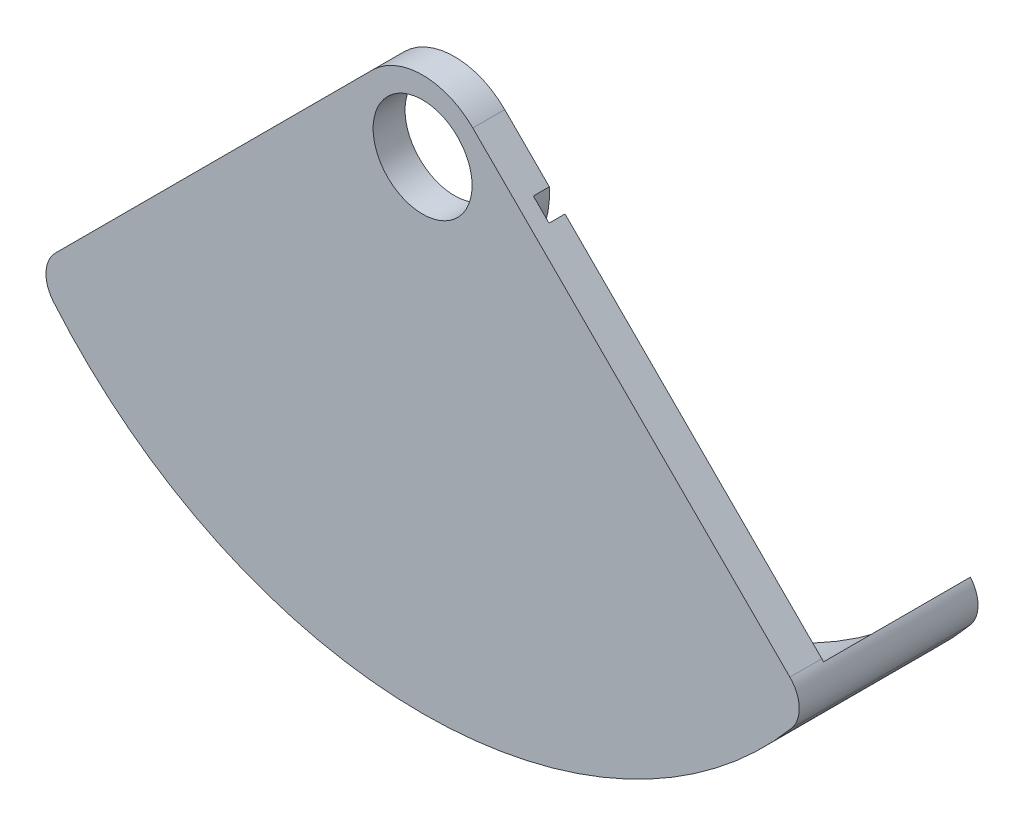
ISO-10303-21;
HEADER;
FILE_DESCRIPTION(('STEP AP214'),'2;1');
FILE_NAME('part.step','',(''),(''),'','','');
FILE_SCHEMA(('AUTOMOTIVE_DESIGN { 1 0 10303 214 1 1 1 1 }'));
ENDSEC;
DATA;
#1=APPLICATION_CONTEXT('core data for automotive mechanical design processes');
#2=APPLICATION_PROTOCOL_DEFINITION('international standard','automotive_design',2000,#1);
#3=PRODUCT_CONTEXT('',#1,'mechanical');
#4=PRODUCT('Part','Part','',(#3));
#5=PRODUCT_RELATED_PRODUCT_CATEGORY('part','',(#4));
#6=PRODUCT_DEFINITION_FORMATION('','',#4);
#7=PRODUCT_DEFINITION_CONTEXT('part definition',#1,'design');
#8=PRODUCT_DEFINITION('design','',#6,#7);
#9=PRODUCT_DEFINITION_SHAPE('','',#8);
#10=(LENGTH_UNIT() NAMED_UNIT(*) SI_UNIT(.MILLI.,.METRE.));
#11=(NAMED_UNIT(*) PLANE_ANGLE_UNIT() SI_UNIT($,.RADIAN.));
#12=(NAMED_UNIT(*) SI_UNIT($,.STERADIAN.) SOLID_ANGLE_UNIT());
#13=UNCERTAINTY_MEASURE_WITH_UNIT(LENGTH_MEASURE(1.E-05),#10,'distance_accuracy_value','');
#14=(GEOMETRIC_REPRESENTATION_CONTEXT(3) GLOBAL_UNCERTAINTY_ASSIGNED_CONTEXT((#13)) GLOBAL_UNIT_ASSIGNED_CONTEXT((#10,
#11,#12)) REPRESENTATION_CONTEXT('',''));
#15=CARTESIAN_POINT('',(0.,0.,0.));
#16=DIRECTION('',(0.,0.,1.));
#17=DIRECTION('',(1.,0.,0.));
#18=AXIS2_PLACEMENT_3D('',#15,#16,#17);
#19=CARTESIAN_POINT('',(0.,0.,-1.));
#20=DIRECTION('',(0.,0.,1.));
#21=DIRECTION('',(1.,0.,0.));
#22=AXIS2_PLACEMENT_3D('',#19,#20,#21);
#23=PLANE('',#22);
#24=CARTESIAN_POINT('',(0.,0.,-1.));
#25=DIRECTION('',(0.,0.,1.));
#26=DIRECTION('',(-1.,0.,0.));
#27=AXIS2_PLACEMENT_3D('',#24,#25,#26);
#28=CIRCLE('',#27,14.3);
#29=CARTESIAN_POINT('',(-11.5598971215994,-8.4177656499832,-1.));
#30=VERTEX_POINT('',#29);
#31=CARTESIAN_POINT('',(11.5598971215994,-8.41776564998319,-1.));
#32=VERTEX_POINT('',#31);
#33=EDGE_CURVE('E159',#30,#32,#28,.T.);
#34=ORIENTED_EDGE('',*,*,#33,.F.);
#35=CARTESIAN_POINT('',(-10.7987124140493,-9.06630080014218,-1.));
#36=DIRECTION('',(0.,0.,1.));
#37=DIRECTION('',(1.,0.,0.));
#38=AXIS2_PLACEMENT_3D('',#35,#36,#37);
#39=CIRCLE('',#38,1.);
#40=CARTESIAN_POINT('',(-11.5058191952358,-8.35919401895563,-1.));
#41=VERTEX_POINT('',#40);
#42=EDGE_CURVE('E207',#41,#30,#39,.T.);
#43=ORIENTED_EDGE('',*,*,#42,.F.);
#44=DIRECTION('',(-0.707106781186549,-0.707106781186547,0.));
#45=VECTOR('',#44,1.);
#46=CARTESIAN_POINT('',(-1.57331258814007,1.57331258814007,-1.));
#47=LINE('',#46,#45);
#48=CARTESIAN_POINT('',(-3.46077119695776,-0.314146020677614,-1.));
#49=VERTEX_POINT('',#48);
#50=EDGE_CURVE('E203',#49,#41,#47,.T.);
#51=ORIENTED_EDGE('',*,*,#50,.F.);
#52=CARTESIAN_POINT('',(0.,0.,-1.));
#53=DIRECTION('',(0.,0.,-1.));
#54=DIRECTION('',(-1.,0.,0.));
#55=AXIS2_PLACEMENT_3D('',#52,#53,#54);
#56=CIRCLE('',#55,3.475);
#57=CARTESIAN_POINT('',(3.46077119695776,-0.314146020677614,-1.));
#58=VERTEX_POINT('',#57);
#59=EDGE_CURVE('E180',#58,#49,#56,.T.);
#60=ORIENTED_EDGE('',*,*,#59,.F.);
#61=DIRECTION('',(-0.707106781186549,0.707106781186546,0.));
#62=VECTOR('',#61,1.);
#63=CARTESIAN_POINT('',(1.57331258814007,1.57331258814007,-1.));
#64=LINE('',#63,#62);
#65=CARTESIAN_POINT('',(11.5058191952358,-8.35919401895563,-1.));
#66=VERTEX_POINT('',#65);
#67=EDGE_CURVE('E211',#66,#58,#64,.T.);
#68=ORIENTED_EDGE('',*,*,#67,.F.);
#69=CARTESIAN_POINT('',(10.7987124140493,-9.06630080014217,-1.));
#70=DIRECTION('',(0.,0.,1.));
#71=DIRECTION('',(-1.,0.,0.));
#72=AXIS2_PLACEMENT_3D('',#69,#70,#71);
#73=CIRCLE('',#72,1.);
#74=EDGE_CURVE('E209',#32,#66,#73,.T.);
#75=ORIENTED_EDGE('',*,*,#74,.F.);
#76=EDGE_LOOP('',(#34,#43,#51,#60,#68,#75));
#77=FACE_BOUND('',#76,.T.);
#78=ADVANCED_FACE('F36',(#77),#23,.F.);
#79=CARTESIAN_POINT('',(0.,0.,-1.));
#80=DIRECTION('',(0.,0.,1.));
#81=DIRECTION('',(1.,0.,0.));
#82=AXIS2_PLACEMENT_3D('',#79,#80,#81);
#83=CYLINDRICAL_SURFACE('',#82,2.225);
#84=CARTESIAN_POINT('',(0.,0.,0.));
#85=DIRECTION('',(0.,0.,1.));
#86=DIRECTION('',(1.,0.,0.));
#87=AXIS2_PLACEMENT_3D('',#84,#85,#86);
#88=CIRCLE('',#87,2.225);
#89=CARTESIAN_POINT('',(1.57331258814007,1.57331258814007,0.));
#90=VERTEX_POINT('',#89);
#91=CARTESIAN_POINT('',(-1.57331258814007,1.57331258814007,0.));
#92=VERTEX_POINT('',#91);
#93=EDGE_CURVE('E197',#90,#92,#88,.T.);
#94=ORIENTED_EDGE('',*,*,#93,.F.);
#95=DIRECTION('',(0.,0.,1.));
#96=VECTOR('',#95,1.);
#97=CARTESIAN_POINT('',(1.57331258814007,1.57331258814007,-1.));
#98=LINE('',#97,#96);
#99=CARTESIAN_POINT('',(1.57331258814007,1.57331258814007,-1.));
#100=VERTEX_POINT('',#99);
#101=EDGE_CURVE('E11',#100,#90,#98,.T.);
#102=ORIENTED_EDGE('',*,*,#101,.F.);
#103=CARTESIAN_POINT('',(0.,0.,-1.));
#104=DIRECTION('',(0.,0.,1.));
#105=DIRECTION('',(1.,0.,0.));
#106=AXIS2_PLACEMENT_3D('',#103,#104,#105);
#107=CIRCLE('',#106,2.225);
#108=CARTESIAN_POINT('',(-1.57331258814007,1.57331258814007,-1.));
#109=VERTEX_POINT('',#108);
#110=EDGE_CURVE('E200',#100,#109,#107,.T.);
#111=ORIENTED_EDGE('',*,*,#110,.T.);
#112=DIRECTION('',(0.,0.,1.));
#113=VECTOR('',#112,1.);
#114=CARTESIAN_POINT('',(-1.57331258814007,1.57331258814007,-1.));
#115=LINE('',#114,#113);
#116=EDGE_CURVE('E40',#109,#92,#115,.T.);
#117=ORIENTED_EDGE('',*,*,#116,.T.);
#118=EDGE_LOOP('',(#94,#102,#111,#117));
#119=FACE_BOUND('',#118,.T.);
#120=ADVANCED_FACE('F38',(#119),#83,.T.);
#121=CARTESIAN_POINT('',(1.57331258814007,1.57331258814007,-1.));
#122=DIRECTION('',(0.707106781186546,0.707106781186549,0.));
#123=DIRECTION('',(-0.707106781186549,0.707106781186546,0.));
#124=AXIS2_PLACEMENT_3D('',#121,#122,#123);
#125=PLANE('',#124);
#126=DIRECTION('',(0.,0.,-1.));
#127=VECTOR('',#126,1.);
#128=CARTESIAN_POINT('',(3.46077119695776,-0.314146020677614,-0.5));
#129=LINE('',#128,#127);
#130=CARTESIAN_POINT('',(3.46077119695776,-0.314146020677614,-0.5));
#131=VERTEX_POINT('',#130);
#132=EDGE_CURVE('E169',#131,#58,#129,.T.);
#133=ORIENTED_EDGE('',*,*,#132,.F.);
#134=DIRECTION('',(0.707106781186549,-0.707106781186546,0.));
#135=VECTOR('',#134,1.);
#136=CARTESIAN_POINT('',(2.96973659251696,0.176888583763178,-0.5));
#137=LINE('',#136,#135);
#138=CARTESIAN_POINT('',(2.96973659251696,0.176888583763179,-0.5));
#139=VERTEX_POINT('',#138);
#140=EDGE_CURVE('E173',#139,#131,#137,.T.);
#141=ORIENTED_EDGE('',*,*,#140,.F.);
#142=DIRECTION('',(0.,0.,-1.));
#143=VECTOR('',#142,1.);
#144=CARTESIAN_POINT('',(2.96973659251696,0.176888583763179,-0.5));
#145=LINE('',#144,#143);
#146=CARTESIAN_POINT('',(2.96973659251696,0.176888583763179,-1.));
#147=VERTEX_POINT('',#146);
#148=EDGE_CURVE('E175',#139,#147,#145,.T.);
#149=ORIENTED_EDGE('',*,*,#148,.T.);
#150=EDGE_CURVE('E61',#147,#100,#64,.T.);
#151=ORIENTED_EDGE('',*,*,#150,.T.);
#152=ORIENTED_EDGE('',*,*,#101,.T.);
#153=DIRECTION('',(-0.707106781186549,0.707106781186546,0.));
#154=VECTOR('',#153,1.);
#155=CARTESIAN_POINT('',(1.57331258814007,1.57331258814007,0.));
#156=LINE('',#155,#154);
#157=CARTESIAN_POINT('',(11.5058191952358,-8.35919401895563,0.));
#158=VERTEX_POINT('',#157);
#159=EDGE_CURVE('E204',#158,#90,#156,.T.);
#160=ORIENTED_EDGE('',*,*,#159,.F.);
#161=DIRECTION('',(0.,0.,1.));
#162=VECTOR('',#161,1.);
#163=CARTESIAN_POINT('',(11.5058191952358,-8.35919401895563,-1.));
#164=LINE('',#163,#162);
#165=EDGE_CURVE('E45',#66,#158,#164,.T.);
#166=ORIENTED_EDGE('',*,*,#165,.F.);
#167=ORIENTED_EDGE('',*,*,#67,.T.);
#168=EDGE_LOOP('',(#133,#141,#149,#151,#152,#160,#166,#167));
#169=FACE_BOUND('',#168,.T.);
#170=ADVANCED_FACE('F237',(#169),#125,.T.);
#171=CARTESIAN_POINT('',(10.7987124140493,-9.06630080014217,-1.));
#172=DIRECTION('',(0.,0.,1.));
#173=DIRECTION('',(1.,0.,0.));
#174=AXIS2_PLACEMENT_3D('',#171,#172,#173);
#175=CYLINDRICAL_SURFACE('',#174,1.);
#176=CARTESIAN_POINT('',(10.7987124140493,-9.06630080014217,0.));
#177=DIRECTION('',(0.,0.,1.));
#178=DIRECTION('',(-1.,0.,0.));
#179=AXIS2_PLACEMENT_3D('',#176,#177,#178);
#180=CIRCLE('',#179,1.);
#181=CARTESIAN_POINT('',(11.5645785427052,-9.70930085688985,0.));
#182=VERTEX_POINT('',#181);
#183=EDGE_CURVE('E222',#182,#158,#180,.T.);
#184=ORIENTED_EDGE('',*,*,#183,.F.);
#185=DIRECTION('',(0.,0.,1.));
#186=VECTOR('',#185,1.);
#187=CARTESIAN_POINT('',(11.5645785427052,-9.70930085688985,-1.));
#188=LINE('',#187,#186);
#189=CARTESIAN_POINT('',(11.5645785427052,-9.70930085688985,-5.6));
#190=VERTEX_POINT('',#189);
#191=EDGE_CURVE('E143',#190,#182,#188,.T.);
#192=ORIENTED_EDGE('',*,*,#191,.F.);
#193=CARTESIAN_POINT('',(10.7987124140493,-9.06630080014217,-5.6));
#194=DIRECTION('',(0.,0.,-1.));
#195=DIRECTION('',(-1.,0.,0.));
#196=AXIS2_PLACEMENT_3D('',#193,#194,#195);
#197=CIRCLE('',#196,1.);
#198=CARTESIAN_POINT('',(11.5598971215994,-8.41776564998319,-5.6));
#199=VERTEX_POINT('',#198);
#200=EDGE_CURVE('E158',#199,#190,#197,.T.);
#201=ORIENTED_EDGE('',*,*,#200,.F.);
#202=DIRECTION('',(0.,0.,1.));
#203=VECTOR('',#202,1.);
#204=CARTESIAN_POINT('',(11.5598971215994,-8.41776564998319,-5.6));
#205=LINE('',#204,#203);
#206=EDGE_CURVE('E164',#199,#32,#205,.T.);
#207=ORIENTED_EDGE('',*,*,#206,.T.);
#208=ORIENTED_EDGE('',*,*,#74,.T.);
#209=ORIENTED_EDGE('',*,*,#165,.T.);
#210=EDGE_LOOP('',(#184,#192,#201,#207,#208,#209));
#211=FACE_BOUND('',#210,.T.);
#212=ADVANCED_FACE('F317',(#211),#175,.T.);
#213=CARTESIAN_POINT('',(0.,0.,-1.));
#214=DIRECTION('',(0.,0.,1.));
#215=DIRECTION('',(1.,0.,0.));
#216=AXIS2_PLACEMENT_3D('',#213,#214,#215);
#217=CYLINDRICAL_SURFACE('',#216,15.1);
#218=CARTESIAN_POINT('',(0.,0.,0.));
#219=DIRECTION('',(0.,0.,1.));
#220=DIRECTION('',(1.,0.,0.));
#221=AXIS2_PLACEMENT_3D('',#218,#219,#220);
#222=CIRCLE('',#221,15.1);
#223=CARTESIAN_POINT('',(-11.5645785427052,-9.70930085688985,0.));
#224=VERTEX_POINT('',#223);
#225=EDGE_CURVE('E139',#224,#182,#222,.T.);
#226=ORIENTED_EDGE('',*,*,#225,.F.);
#227=DIRECTION('',(0.,0.,1.));
#228=VECTOR('',#227,1.);
#229=CARTESIAN_POINT('',(-11.5645785427052,-9.70930085688985,-1.));
#230=LINE('',#229,#228);
#231=CARTESIAN_POINT('',(-11.5645785427052,-9.70930085688985,-5.6));
#232=VERTEX_POINT('',#231);
#233=EDGE_CURVE('E133',#232,#224,#230,.T.);
#234=ORIENTED_EDGE('',*,*,#233,.F.);
#235=CARTESIAN_POINT('',(0.,0.,-5.6));
#236=DIRECTION('',(0.,0.,-1.));
#237=DIRECTION('',(-1.,0.,0.));
#238=AXIS2_PLACEMENT_3D('',#235,#236,#237);
#239=CIRCLE('',#238,15.1);
#240=EDGE_CURVE('E137',#190,#232,#239,.T.);
#241=ORIENTED_EDGE('',*,*,#240,.F.);
#242=ORIENTED_EDGE('',*,*,#191,.T.);
#243=EDGE_LOOP('',(#226,#234,#241,#242));
#244=FACE_BOUND('',#243,.T.);
#245=ADVANCED_FACE('F135',(#244),#217,.T.);
#246=CARTESIAN_POINT('',(-10.7987124140493,-9.06630080014218,-1.));
#247=DIRECTION('',(0.,0.,1.));
#248=DIRECTION('',(1.,0.,0.));
#249=AXIS2_PLACEMENT_3D('',#246,#247,#248);
#250=CYLINDRICAL_SURFACE('',#249,1.);
#251=CARTESIAN_POINT('',(-10.7987124140493,-9.06630080014218,0.));
#252=DIRECTION('',(0.,0.,1.));
#253=DIRECTION('',(1.,0.,0.));
#254=AXIS2_PLACEMENT_3D('',#251,#252,#253);
#255=CIRCLE('',#254,1.);
#256=CARTESIAN_POINT('',(-11.5058191952358,-8.35919401895563,0.));
#257=VERTEX_POINT('',#256);
#258=EDGE_CURVE('E219',#257,#224,#255,.T.);
#259=ORIENTED_EDGE('',*,*,#258,.F.);
#260=DIRECTION('',(0.,0.,1.));
#261=VECTOR('',#260,1.);
#262=CARTESIAN_POINT('',(-11.5058191952358,-8.35919401895563,-1.));
#263=LINE('',#262,#261);
#264=EDGE_CURVE('E144',#41,#257,#263,.T.);
#265=ORIENTED_EDGE('',*,*,#264,.F.);
#266=ORIENTED_EDGE('',*,*,#42,.T.);
#267=DIRECTION('',(0.,0.,1.));
#268=VECTOR('',#267,1.);
#269=CARTESIAN_POINT('',(-11.5598971215994,-8.4177656499832,-5.6));
#270=LINE('',#269,#268);
#271=CARTESIAN_POINT('',(-11.5598971215994,-8.4177656499832,-5.6));
#272=VERTEX_POINT('',#271);
#273=EDGE_CURVE('E150',#272,#30,#270,.T.);
#274=ORIENTED_EDGE('',*,*,#273,.F.);
#275=CARTESIAN_POINT('',(-10.7987124140493,-9.06630080014218,-5.6));
#276=DIRECTION('',(0.,0.,-1.));
#277=DIRECTION('',(-1.,0.,0.));
#278=AXIS2_PLACEMENT_3D('',#275,#276,#277);
#279=CIRCLE('',#278,1.);
#280=EDGE_CURVE('E147',#232,#272,#279,.T.);
#281=ORIENTED_EDGE('',*,*,#280,.F.);
#282=ORIENTED_EDGE('',*,*,#233,.T.);
#283=EDGE_LOOP('',(#259,#265,#266,#274,#281,#282));
#284=FACE_BOUND('',#283,.T.);
#285=ADVANCED_FACE('F148',(#284),#250,.T.);
#286=CARTESIAN_POINT('',(-1.57331258814007,1.57331258814007,-1.));
#287=DIRECTION('',(-0.707106781186547,0.707106781186549,0.));
#288=DIRECTION('',(-0.707106781186549,-0.707106781186546,0.));
#289=AXIS2_PLACEMENT_3D('',#286,#287,#288);
#290=PLANE('',#289);
#291=DIRECTION('',(0.,0.,-1.));
#292=VECTOR('',#291,1.);
#293=CARTESIAN_POINT('',(-3.46077119695776,-0.314146020677614,-0.5));
#294=LINE('',#293,#292);
#295=CARTESIAN_POINT('',(-3.46077119695776,-0.314146020677614,-0.5));
#296=VERTEX_POINT('',#295);
#297=EDGE_CURVE('E170',#296,#49,#294,.T.);
#298=ORIENTED_EDGE('',*,*,#297,.T.);
#299=ORIENTED_EDGE('',*,*,#50,.T.);
#300=ORIENTED_EDGE('',*,*,#264,.T.);
#301=DIRECTION('',(-0.707106781186549,-0.707106781186547,0.));
#302=VECTOR('',#301,1.);
#303=CARTESIAN_POINT('',(-1.57331258814007,1.57331258814007,0.));
#304=LINE('',#303,#302);
#305=EDGE_CURVE('E216',#92,#257,#304,.T.);
#306=ORIENTED_EDGE('',*,*,#305,.F.);
#307=ORIENTED_EDGE('',*,*,#116,.F.);
#308=CARTESIAN_POINT('',(-2.96973659251696,0.176888583763178,-1.));
#309=VERTEX_POINT('',#308);
#310=EDGE_CURVE('E205',#109,#309,#47,.T.);
#311=ORIENTED_EDGE('',*,*,#310,.T.);
#312=DIRECTION('',(0.,0.,-1.));
#313=VECTOR('',#312,1.);
#314=CARTESIAN_POINT('',(-2.96973659251696,0.176888583763178,-0.5));
#315=LINE('',#314,#313);
#316=CARTESIAN_POINT('',(-2.96973659251696,0.176888583763178,-0.5));
#317=VERTEX_POINT('',#316);
#318=EDGE_CURVE('E53',#317,#309,#315,.T.);
#319=ORIENTED_EDGE('',*,*,#318,.F.);
#320=DIRECTION('',(0.707106781186549,0.707106781186546,0.));
#321=VECTOR('',#320,1.);
#322=CARTESIAN_POINT('',(-3.46077119695776,-0.314146020677614,-0.5));
#323=LINE('',#322,#321);
#324=EDGE_CURVE('E189',#296,#317,#323,.T.);
#325=ORIENTED_EDGE('',*,*,#324,.F.);
#326=EDGE_LOOP('',(#298,#299,#300,#306,#307,#311,#319,#325));
#327=FACE_BOUND('',#326,.T.);
#328=ADVANCED_FACE('F231',(#327),#290,.T.);
#329=CARTESIAN_POINT('',(0.,0.,-1.));
#330=DIRECTION('',(0.,0.,1.));
#331=DIRECTION('',(1.,0.,0.));
#332=AXIS2_PLACEMENT_3D('',#329,#330,#331);
#333=CIRCLE('',#332,1.55);
#334=CARTESIAN_POINT('',(1.55,0.,-1.));
#335=VERTEX_POINT('',#334);
#336=EDGE_CURVE('E194',#335,#335,#333,.T.);
#337=ORIENTED_EDGE('',*,*,#336,.T.);
#338=EDGE_LOOP('',(#337));
#339=FACE_BOUND('',#338,.T.);
#340=ORIENTED_EDGE('',*,*,#150,.F.);
#341=CARTESIAN_POINT('',(0.,0.,-1.));
#342=DIRECTION('',(0.,0.,1.));
#343=DIRECTION('',(-1.,0.,0.));
#344=AXIS2_PLACEMENT_3D('',#341,#342,#343);
#345=CIRCLE('',#344,2.975);
#346=EDGE_CURVE('E178',#309,#147,#345,.T.);
#347=ORIENTED_EDGE('',*,*,#346,.F.);
#348=ORIENTED_EDGE('',*,*,#310,.F.);
#349=ORIENTED_EDGE('',*,*,#110,.F.);
#350=EDGE_LOOP('',(#340,#347,#348,#349));
#351=FACE_BOUND('',#350,.T.);
#352=ADVANCED_FACE('F253',(#339,#351),#23,.F.);
#353=CARTESIAN_POINT('',(0.,0.,0.));
#354=DIRECTION('',(0.,0.,1.));
#355=DIRECTION('',(1.,0.,0.));
#356=AXIS2_PLACEMENT_3D('',#353,#354,#355);
#357=PLANE('',#356);
#358=CARTESIAN_POINT('',(0.,0.,0.));
#359=DIRECTION('',(0.,0.,1.));
#360=DIRECTION('',(1.,0.,0.));
#361=AXIS2_PLACEMENT_3D('',#358,#359,#360);
#362=CIRCLE('',#361,1.55);
#363=CARTESIAN_POINT('',(1.55,0.,0.));
#364=VERTEX_POINT('',#363);
#365=EDGE_CURVE('E183',#364,#364,#362,.T.);
#366=ORIENTED_EDGE('',*,*,#365,.F.);
#367=EDGE_LOOP('',(#366));
#368=FACE_BOUND('',#367,.T.);
#369=ORIENTED_EDGE('',*,*,#93,.T.);
#370=ORIENTED_EDGE('',*,*,#305,.T.);
#371=ORIENTED_EDGE('',*,*,#258,.T.);
#372=ORIENTED_EDGE('',*,*,#225,.T.);
#373=ORIENTED_EDGE('',*,*,#183,.T.);
#374=ORIENTED_EDGE('',*,*,#159,.T.);
#375=EDGE_LOOP('',(#369,#370,#371,#372,#373,#374));
#376=FACE_BOUND('',#375,.T.);
#377=ADVANCED_FACE('F233',(#368,#376),#357,.T.);
#378=CARTESIAN_POINT('',(0.,0.,-1.));
#379=DIRECTION('',(0.,0.,1.));
#380=DIRECTION('',(1.,0.,0.));
#381=AXIS2_PLACEMENT_3D('',#378,#379,#380);
#382=CYLINDRICAL_SURFACE('',#381,1.55);
#383=ORIENTED_EDGE('',*,*,#336,.F.);
#384=EDGE_LOOP('',(#383));
#385=FACE_BOUND('',#384,.T.);
#386=ORIENTED_EDGE('',*,*,#365,.T.);
#387=EDGE_LOOP('',(#386));
#388=FACE_BOUND('',#387,.T.);
#389=ADVANCED_FACE('F263',(#385,#388),#382,.F.);
#390=CARTESIAN_POINT('',(0.,0.,-0.5));
#391=DIRECTION('',(0.,0.,-1.));
#392=DIRECTION('',(-1.,0.,0.));
#393=AXIS2_PLACEMENT_3D('',#390,#391,#392);
#394=CYLINDRICAL_SURFACE('',#393,3.475);
#395=ORIENTED_EDGE('',*,*,#59,.T.);
#396=ORIENTED_EDGE('',*,*,#297,.F.);
#397=CARTESIAN_POINT('',(0.,0.,-0.5));
#398=DIRECTION('',(0.,0.,-1.));
#399=DIRECTION('',(-1.,0.,0.));
#400=AXIS2_PLACEMENT_3D('',#397,#398,#399);
#401=CIRCLE('',#400,3.475);
#402=EDGE_CURVE('E181',#131,#296,#401,.T.);
#403=ORIENTED_EDGE('',*,*,#402,.F.);
#404=ORIENTED_EDGE('',*,*,#132,.T.);
#405=EDGE_LOOP('',(#395,#396,#403,#404));
#406=FACE_BOUND('',#405,.T.);
#407=ADVANCED_FACE('F247',(#406),#394,.F.);
#408=CARTESIAN_POINT('',(0.,0.,-0.5));
#409=DIRECTION('',(0.,0.,-1.));
#410=DIRECTION('',(-1.,0.,0.));
#411=AXIS2_PLACEMENT_3D('',#408,#409,#410);
#412=CYLINDRICAL_SURFACE('',#411,2.975);
#413=ORIENTED_EDGE('',*,*,#346,.T.);
#414=ORIENTED_EDGE('',*,*,#148,.F.);
#415=CARTESIAN_POINT('',(0.,0.,-0.5));
#416=DIRECTION('',(0.,0.,1.));
#417=DIRECTION('',(-1.,0.,0.));
#418=AXIS2_PLACEMENT_3D('',#415,#416,#417);
#419=CIRCLE('',#418,2.975);
#420=EDGE_CURVE('E186',#317,#139,#419,.T.);
#421=ORIENTED_EDGE('',*,*,#420,.F.);
#422=ORIENTED_EDGE('',*,*,#318,.T.);
#423=EDGE_LOOP('',(#413,#414,#421,#422));
#424=FACE_BOUND('',#423,.T.);
#425=ADVANCED_FACE('F254',(#424),#412,.T.);
#426=CARTESIAN_POINT('',(0.,0.,-0.5));
#427=DIRECTION('',(0.,0.,-1.));
#428=DIRECTION('',(-1.,0.,0.));
#429=AXIS2_PLACEMENT_3D('',#426,#427,#428);
#430=PLANE('',#429);
#431=ORIENTED_EDGE('',*,*,#402,.T.);
#432=ORIENTED_EDGE('',*,*,#324,.T.);
#433=ORIENTED_EDGE('',*,*,#420,.T.);
#434=ORIENTED_EDGE('',*,*,#140,.T.);
#435=EDGE_LOOP('',(#431,#432,#433,#434));
#436=FACE_BOUND('',#435,.T.);
#437=ADVANCED_FACE('F250',(#436),#430,.T.);
#438=CARTESIAN_POINT('',(0.,0.,-5.6));
#439=DIRECTION('',(0.,0.,1.));
#440=DIRECTION('',(1.,0.,0.));
#441=AXIS2_PLACEMENT_3D('',#438,#439,#440);
#442=CYLINDRICAL_SURFACE('',#441,14.3);
#443=ORIENTED_EDGE('',*,*,#33,.T.);
#444=ORIENTED_EDGE('',*,*,#206,.F.);
#445=CARTESIAN_POINT('',(0.,0.,-5.6));
#446=DIRECTION('',(0.,0.,1.));
#447=DIRECTION('',(-1.,0.,0.));
#448=AXIS2_PLACEMENT_3D('',#445,#446,#447);
#449=CIRCLE('',#448,14.3);
#450=EDGE_CURVE('E153',#272,#199,#449,.T.);
#451=ORIENTED_EDGE('',*,*,#450,.F.);
#452=ORIENTED_EDGE('',*,*,#273,.T.);
#453=EDGE_LOOP('',(#443,#444,#451,#452));
#454=FACE_BOUND('',#453,.T.);
#455=ADVANCED_FACE('F261',(#454),#442,.F.);
#456=CARTESIAN_POINT('',(-5.39935620702463,-4.53315040007109,-5.6));
#457=DIRECTION('',(0.,0.,-1.));
#458=DIRECTION('',(-1.,0.,0.));
#459=AXIS2_PLACEMENT_3D('',#456,#457,#458);
#460=PLANE('',#459);
#461=ORIENTED_EDGE('',*,*,#240,.T.);
#462=ORIENTED_EDGE('',*,*,#280,.T.);
#463=ORIENTED_EDGE('',*,*,#450,.T.);
#464=ORIENTED_EDGE('',*,*,#200,.T.);
#465=EDGE_LOOP('',(#461,#462,#463,#464));
#466=FACE_BOUND('',#465,.T.);
#467=ADVANCED_FACE('F156',(#466),#460,.T.);
#468=CLOSED_SHELL('',(#78,#120,#170,#212,#245,#285,#328,#352,#377,#389,#407,#425,#437,#455,#467));
#469=MANIFOLD_SOLID_BREP('B2',#468);
#470=ADVANCED_BREP_SHAPE_REPRESENTATION('',(#18,#469),#14);
#471=SHAPE_DEFINITION_REPRESENTATION(#9,#470);
ENDSEC;
END-ISO-10303-21;
